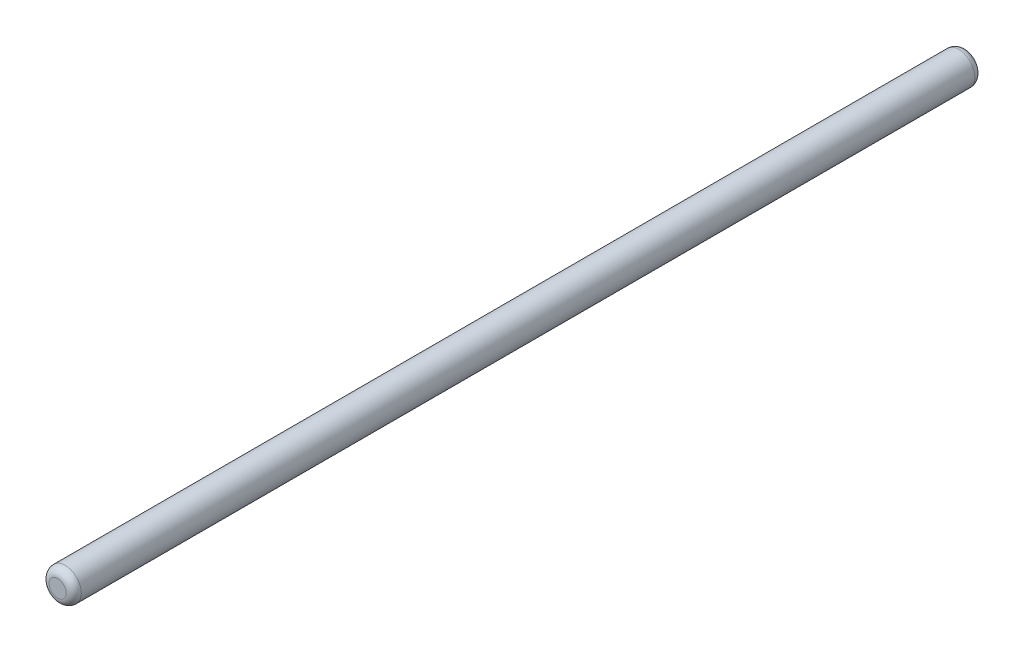
ISO-10303-21;
HEADER;
FILE_DESCRIPTION(('STEP AP214'),'2;1');
FILE_NAME('part.step','',(''),(''),'','','');
FILE_SCHEMA(('AUTOMOTIVE_DESIGN { 1 0 10303 214 1 1 1 1 }'));
ENDSEC;
DATA;
#1=APPLICATION_CONTEXT('core data for automotive mechanical design processes');
#2=APPLICATION_PROTOCOL_DEFINITION('international standard','automotive_design',2000,#1);
#3=PRODUCT_CONTEXT('',#1,'mechanical');
#4=PRODUCT('Part','Part','',(#3));
#5=PRODUCT_RELATED_PRODUCT_CATEGORY('part','',(#4));
#6=PRODUCT_DEFINITION_FORMATION('','',#4);
#7=PRODUCT_DEFINITION_CONTEXT('part definition',#1,'design');
#8=PRODUCT_DEFINITION('design','',#6,#7);
#9=PRODUCT_DEFINITION_SHAPE('','',#8);
#10=(LENGTH_UNIT() NAMED_UNIT(*) SI_UNIT(.MILLI.,.METRE.));
#11=(NAMED_UNIT(*) PLANE_ANGLE_UNIT() SI_UNIT($,.RADIAN.));
#12=(NAMED_UNIT(*) SI_UNIT($,.STERADIAN.) SOLID_ANGLE_UNIT());
#13=UNCERTAINTY_MEASURE_WITH_UNIT(LENGTH_MEASURE(1.E-05),#10,'distance_accuracy_value','');
#14=(GEOMETRIC_REPRESENTATION_CONTEXT(3) GLOBAL_UNCERTAINTY_ASSIGNED_CONTEXT((#13)) GLOBAL_UNIT_ASSIGNED_CONTEXT((#10,
#11,#12)) REPRESENTATION_CONTEXT('',''));
#15=CARTESIAN_POINT('',(0.,0.,0.));
#16=DIRECTION('',(0.,0.,1.));
#17=DIRECTION('',(1.,0.,0.));
#18=AXIS2_PLACEMENT_3D('',#15,#16,#17);
#19=CARTESIAN_POINT('',(0.,0.,120.));
#20=DIRECTION('',(0.,0.,-1.));
#21=DIRECTION('',(-1.,0.,0.));
#22=AXIS2_PLACEMENT_3D('',#19,#20,#21);
#23=CYLINDRICAL_SURFACE('',#22,4.25);
#24=CARTESIAN_POINT('',(0.,0.,-118.));
#25=DIRECTION('',(0.,0.,1.));
#26=DIRECTION('',(1.,0.,0.));
#27=AXIS2_PLACEMENT_3D('',#24,#25,#26);
#28=CIRCLE('',#27,4.25);
#29=CARTESIAN_POINT('',(4.25,0.,-118.));
#30=VERTEX_POINT('',#29);
#31=EDGE_CURVE('E46',#30,#30,#28,.T.);
#32=ORIENTED_EDGE('',*,*,#31,.T.);
#33=EDGE_LOOP('',(#32));
#34=FACE_BOUND('',#33,.T.);
#35=CARTESIAN_POINT('',(0.,0.,118.));
#36=DIRECTION('',(0.,0.,1.));
#37=DIRECTION('',(1.,0.,0.));
#38=AXIS2_PLACEMENT_3D('',#35,#36,#37);
#39=CIRCLE('',#38,4.25);
#40=CARTESIAN_POINT('',(4.25,0.,118.));
#41=VERTEX_POINT('',#40);
#42=EDGE_CURVE('E50',#41,#41,#39,.F.);
#43=ORIENTED_EDGE('',*,*,#42,.T.);
#44=EDGE_LOOP('',(#43));
#45=FACE_BOUND('',#44,.T.);
#46=ADVANCED_FACE('F35',(#34,#45),#23,.T.);
#47=CARTESIAN_POINT('',(0.,0.,120.));
#48=DIRECTION('',(0.,0.,1.));
#49=DIRECTION('',(1.,0.,0.));
#50=AXIS2_PLACEMENT_3D('',#47,#48,#49);
#51=PLANE('',#50);
#52=CARTESIAN_POINT('',(0.,0.,120.));
#53=DIRECTION('',(0.,0.,1.));
#54=DIRECTION('',(1.,0.,0.));
#55=AXIS2_PLACEMENT_3D('',#52,#53,#54);
#56=CIRCLE('',#55,2.25);
#57=CARTESIAN_POINT('',(2.25,0.,120.));
#58=VERTEX_POINT('',#57);
#59=EDGE_CURVE('E10',#58,#58,#56,.T.);
#60=ORIENTED_EDGE('',*,*,#59,.T.);
#61=EDGE_LOOP('',(#60));
#62=FACE_BOUND('',#61,.T.);
#63=ADVANCED_FACE('F66',(#62),#51,.T.);
#64=CARTESIAN_POINT('',(0.,0.,-120.));
#65=DIRECTION('',(0.,0.,1.));
#66=DIRECTION('',(1.,0.,0.));
#67=AXIS2_PLACEMENT_3D('',#64,#65,#66);
#68=PLANE('',#67);
#69=CARTESIAN_POINT('',(0.,0.,-120.));
#70=DIRECTION('',(0.,0.,1.));
#71=DIRECTION('',(1.,0.,0.));
#72=AXIS2_PLACEMENT_3D('',#69,#70,#71);
#73=CIRCLE('',#72,2.25);
#74=CARTESIAN_POINT('',(2.25,0.,-120.));
#75=VERTEX_POINT('',#74);
#76=EDGE_CURVE('E42',#75,#75,#73,.F.);
#77=ORIENTED_EDGE('',*,*,#76,.T.);
#78=EDGE_LOOP('',(#77));
#79=FACE_BOUND('',#78,.T.);
#80=ADVANCED_FACE('F63',(#79),#68,.F.);
#81=CARTESIAN_POINT('',(0.,0.,-118.));
#82=DIRECTION('',(0.,0.,1.));
#83=DIRECTION('',(1.,0.,0.));
#84=AXIS2_PLACEMENT_3D('',#81,#82,#83);
#85=TOROIDAL_SURFACE('',#84,2.25,2.);
#86=ORIENTED_EDGE('',*,*,#76,.F.);
#87=EDGE_LOOP('',(#86));
#88=FACE_BOUND('',#87,.T.);
#89=ORIENTED_EDGE('',*,*,#31,.F.);
#90=EDGE_LOOP('',(#89));
#91=FACE_BOUND('',#90,.T.);
#92=ADVANCED_FACE('F59',(#88,#91),#85,.T.);
#93=CARTESIAN_POINT('',(0.,0.,118.));
#94=DIRECTION('',(0.,0.,1.));
#95=DIRECTION('',(1.,0.,0.));
#96=AXIS2_PLACEMENT_3D('',#93,#94,#95);
#97=TOROIDAL_SURFACE('',#96,2.25,2.);
#98=ORIENTED_EDGE('',*,*,#42,.F.);
#99=EDGE_LOOP('',(#98));
#100=FACE_BOUND('',#99,.T.);
#101=ORIENTED_EDGE('',*,*,#59,.F.);
#102=EDGE_LOOP('',(#101));
#103=FACE_BOUND('',#102,.T.);
#104=ADVANCED_FACE('F37',(#100,#103),#97,.T.);
#105=CLOSED_SHELL('',(#46,#63,#80,#92,#104));
#106=MANIFOLD_SOLID_BREP('B2',#105);
#107=ADVANCED_BREP_SHAPE_REPRESENTATION('',(#18,#106),#14);
#108=SHAPE_DEFINITION_REPRESENTATION(#9,#107);
ENDSEC;
END-ISO-10303-21;
